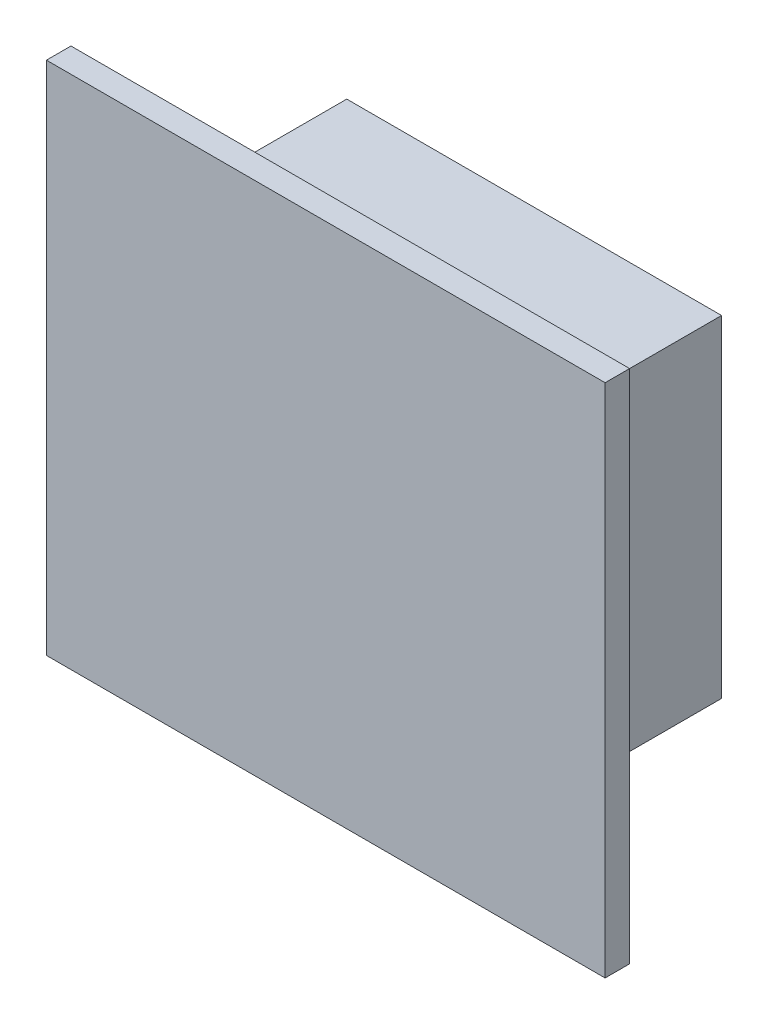
ISO-10303-21;
HEADER;
FILE_DESCRIPTION(('STEP AP214'),'2;1');
FILE_NAME('part.step','',(''),(''),'','','');
FILE_SCHEMA(('AUTOMOTIVE_DESIGN { 1 0 10303 214 1 1 1 1 }'));
ENDSEC;
DATA;
#1=APPLICATION_CONTEXT('core data for automotive mechanical design processes');
#2=APPLICATION_PROTOCOL_DEFINITION('international standard','automotive_design',2000,#1);
#3=PRODUCT_CONTEXT('',#1,'mechanical');
#4=PRODUCT('Part','Part','',(#3));
#5=PRODUCT_RELATED_PRODUCT_CATEGORY('part','',(#4));
#6=PRODUCT_DEFINITION_FORMATION('','',#4);
#7=PRODUCT_DEFINITION_CONTEXT('part definition',#1,'design');
#8=PRODUCT_DEFINITION('design','',#6,#7);
#9=PRODUCT_DEFINITION_SHAPE('','',#8);
#10=(LENGTH_UNIT() NAMED_UNIT(*) SI_UNIT(.MILLI.,.METRE.));
#11=(NAMED_UNIT(*) PLANE_ANGLE_UNIT() SI_UNIT($,.RADIAN.));
#12=(NAMED_UNIT(*) SI_UNIT($,.STERADIAN.) SOLID_ANGLE_UNIT());
#13=UNCERTAINTY_MEASURE_WITH_UNIT(LENGTH_MEASURE(1.E-05),#10,'distance_accuracy_value','');
#14=(GEOMETRIC_REPRESENTATION_CONTEXT(3) GLOBAL_UNCERTAINTY_ASSIGNED_CONTEXT((#13)) GLOBAL_UNIT_ASSIGNED_CONTEXT((#10,
#11,#12)) REPRESENTATION_CONTEXT('',''));
#15=CARTESIAN_POINT('',(0.,0.,0.));
#16=DIRECTION('',(0.,0.,1.));
#17=DIRECTION('',(1.,0.,0.));
#18=AXIS2_PLACEMENT_3D('',#15,#16,#17);
#19=CARTESIAN_POINT('',(0.,0.,0.));
#20=DIRECTION('',(0.,0.,-1.));
#21=DIRECTION('',(-1.,0.,0.));
#22=AXIS2_PLACEMENT_3D('',#19,#20,#21);
#23=PLANE('',#22);
#24=DIRECTION('',(0.,1.,0.));
#25=VECTOR('',#24,1.);
#26=CARTESIAN_POINT('',(40.4241041992261,-41.4117147130097,0.));
#27=LINE('',#26,#25);
#28=CARTESIAN_POINT('',(40.4241041992261,-46.8232067011669,0.));
#29=VERTEX_POINT('',#28);
#30=CARTESIAN_POINT('',(40.4241041992261,-41.4117147130097,0.));
#31=VERTEX_POINT('',#30);
#32=EDGE_CURVE('E54',#29,#31,#27,.T.);
#33=ORIENTED_EDGE('',*,*,#32,.F.);
#34=DIRECTION('',(-1.,0.,0.));
#35=VECTOR('',#34,1.);
#36=CARTESIAN_POINT('',(40.4241041992261,-46.8232067011669,0.));
#37=LINE('',#36,#35);
#38=CARTESIAN_POINT('',(46.5392965275469,-46.8232067011669,0.));
#39=VERTEX_POINT('',#38);
#40=EDGE_CURVE('E58',#39,#29,#37,.T.);
#41=ORIENTED_EDGE('',*,*,#40,.F.);
#42=DIRECTION('',(0.,-1.,0.));
#43=VECTOR('',#42,1.);
#44=CARTESIAN_POINT('',(46.5392965275469,-41.4117147130097,0.));
#45=LINE('',#44,#43);
#46=CARTESIAN_POINT('',(46.5392965275469,-41.4117147130097,0.));
#47=VERTEX_POINT('',#46);
#48=EDGE_CURVE('E286',#47,#39,#45,.T.);
#49=ORIENTED_EDGE('',*,*,#48,.F.);
#50=DIRECTION('',(1.,0.,0.));
#51=VECTOR('',#50,1.);
#52=CARTESIAN_POINT('',(40.4241041992261,-41.4117147130097,0.));
#53=LINE('',#52,#51);
#54=EDGE_CURVE('E292',#31,#47,#53,.T.);
#55=ORIENTED_EDGE('',*,*,#54,.F.);
#56=EDGE_LOOP('',(#33,#41,#49,#55));
#57=FACE_BOUND('',#56,.T.);
#58=DIRECTION('',(0.,1.,0.));
#59=VECTOR('',#58,1.);
#60=CARTESIAN_POINT('',(48.0392965275469,-39.9117147130097,0.));
#61=LINE('',#60,#59);
#62=CARTESIAN_POINT('',(48.0392965275469,-48.3232067011669,0.));
#63=VERTEX_POINT('',#62);
#64=CARTESIAN_POINT('',(48.0392965275469,-39.9117147130097,0.));
#65=VERTEX_POINT('',#64);
#66=EDGE_CURVE('E124',#63,#65,#61,.T.);
#67=ORIENTED_EDGE('',*,*,#66,.F.);
#68=DIRECTION('',(1.,0.,0.));
#69=VECTOR('',#68,1.);
#70=CARTESIAN_POINT('',(48.0392965275469,-48.3232067011669,0.));
#71=LINE('',#70,#69);
#72=CARTESIAN_POINT('',(38.9241041992261,-48.3232067011669,0.));
#73=VERTEX_POINT('',#72);
#74=EDGE_CURVE('E143',#73,#63,#71,.T.);
#75=ORIENTED_EDGE('',*,*,#74,.F.);
#76=DIRECTION('',(0.,-1.,0.));
#77=VECTOR('',#76,1.);
#78=CARTESIAN_POINT('',(38.9241041992261,-39.9117147130097,0.));
#79=LINE('',#78,#77);
#80=CARTESIAN_POINT('',(38.9241041992261,-39.9117147130097,0.));
#81=VERTEX_POINT('',#80);
#82=EDGE_CURVE('E140',#81,#73,#79,.T.);
#83=ORIENTED_EDGE('',*,*,#82,.F.);
#84=DIRECTION('',(-1.,0.,0.));
#85=VECTOR('',#84,1.);
#86=CARTESIAN_POINT('',(48.0392965275469,-39.9117147130097,0.));
#87=LINE('',#86,#85);
#88=EDGE_CURVE('E127',#65,#81,#87,.T.);
#89=ORIENTED_EDGE('',*,*,#88,.F.);
#90=EDGE_LOOP('',(#67,#75,#83,#89));
#91=FACE_BOUND('',#90,.T.);
#92=ADVANCED_FACE('F37',(#57,#91),#23,.T.);
#93=CARTESIAN_POINT('',(48.0392965275469,-48.3232067011669,12.8032225106668));
#94=DIRECTION('',(0.,1.,0.));
#95=DIRECTION('',(0.,0.,1.));
#96=AXIS2_PLACEMENT_3D('',#93,#94,#95);
#97=PLANE('',#96);
#98=DIRECTION('',(0.,0.,-1.));
#99=VECTOR('',#98,1.);
#100=CARTESIAN_POINT('',(48.0392965275469,-48.3232067011669,12.8032225106668));
#101=LINE('',#100,#99);
#102=CARTESIAN_POINT('',(48.0392965275469,-48.3232067011669,0.400000000000005));
#103=VERTEX_POINT('',#102);
#104=EDGE_CURVE('E146',#103,#63,#101,.T.);
#105=ORIENTED_EDGE('',*,*,#104,.F.);
#106=DIRECTION('',(-1.,0.,0.));
#107=VECTOR('',#106,1.);
#108=CARTESIAN_POINT('',(48.0392965275469,-48.3232067011669,0.400000000000005));
#109=LINE('',#108,#107);
#110=CARTESIAN_POINT('',(38.9241041992261,-48.3232067011669,0.400000000000008));
#111=VERTEX_POINT('',#110);
#112=EDGE_CURVE('E41',#103,#111,#109,.T.);
#113=ORIENTED_EDGE('',*,*,#112,.T.);
#114=DIRECTION('',(0.,0.,-1.));
#115=VECTOR('',#114,1.);
#116=CARTESIAN_POINT('',(38.9241041992261,-48.3232067011669,12.8032225106668));
#117=LINE('',#116,#115);
#118=EDGE_CURVE('E148',#111,#73,#117,.T.);
#119=ORIENTED_EDGE('',*,*,#118,.T.);
#120=ORIENTED_EDGE('',*,*,#74,.T.);
#121=EDGE_LOOP('',(#105,#113,#119,#120));
#122=FACE_BOUND('',#121,.T.);
#123=ADVANCED_FACE('F158',(#122),#97,.F.);
#124=CARTESIAN_POINT('',(38.9241041992261,-39.9117147130097,12.8032225106668));
#125=DIRECTION('',(1.,0.,0.));
#126=DIRECTION('',(0.,0.,-1.));
#127=AXIS2_PLACEMENT_3D('',#124,#125,#126);
#128=PLANE('',#127);
#129=ORIENTED_EDGE('',*,*,#118,.F.);
#130=DIRECTION('',(0.,1.,0.));
#131=VECTOR('',#130,1.);
#132=CARTESIAN_POINT('',(38.9241041992261,-39.9117147130097,0.400000000000005));
#133=LINE('',#132,#131);
#134=CARTESIAN_POINT('',(38.9241041992261,-39.9117147130097,0.400000000000005));
#135=VERTEX_POINT('',#134);
#136=EDGE_CURVE('E133',#111,#135,#133,.T.);
#137=ORIENTED_EDGE('',*,*,#136,.T.);
#138=DIRECTION('',(0.,0.,-1.));
#139=VECTOR('',#138,1.);
#140=CARTESIAN_POINT('',(38.9241041992261,-39.9117147130097,12.8032225106668));
#141=LINE('',#140,#139);
#142=EDGE_CURVE('E150',#135,#81,#141,.T.);
#143=ORIENTED_EDGE('',*,*,#142,.T.);
#144=ORIENTED_EDGE('',*,*,#82,.T.);
#145=EDGE_LOOP('',(#129,#137,#143,#144));
#146=FACE_BOUND('',#145,.T.);
#147=ADVANCED_FACE('F168',(#146),#128,.F.);
#148=CARTESIAN_POINT('',(48.0392965275469,-39.9117147130097,12.8032225106668));
#149=DIRECTION('',(0.,-1.,0.));
#150=DIRECTION('',(0.,0.,-1.));
#151=AXIS2_PLACEMENT_3D('',#148,#149,#150);
#152=PLANE('',#151);
#153=ORIENTED_EDGE('',*,*,#142,.F.);
#154=DIRECTION('',(1.,0.,0.));
#155=VECTOR('',#154,1.);
#156=CARTESIAN_POINT('',(48.0392965275469,-39.9117147130097,0.400000000000005));
#157=LINE('',#156,#155);
#158=CARTESIAN_POINT('',(48.0392965275469,-39.9117147130097,0.400000000000005));
#159=VERTEX_POINT('',#158);
#160=EDGE_CURVE('E46',#135,#159,#157,.T.);
#161=ORIENTED_EDGE('',*,*,#160,.T.);
#162=DIRECTION('',(0.,0.,-1.));
#163=VECTOR('',#162,1.);
#164=CARTESIAN_POINT('',(48.0392965275469,-39.9117147130097,12.8032225106668));
#165=LINE('',#164,#163);
#166=EDGE_CURVE('E151',#159,#65,#165,.T.);
#167=ORIENTED_EDGE('',*,*,#166,.T.);
#168=ORIENTED_EDGE('',*,*,#88,.T.);
#169=EDGE_LOOP('',(#153,#161,#167,#168));
#170=FACE_BOUND('',#169,.T.);
#171=ADVANCED_FACE('F165',(#170),#152,.F.);
#172=CARTESIAN_POINT('',(48.0392965275469,-39.9117147130097,12.8032225106668));
#173=DIRECTION('',(-1.,0.,0.));
#174=DIRECTION('',(0.,0.,1.));
#175=AXIS2_PLACEMENT_3D('',#172,#173,#174);
#176=PLANE('',#175);
#177=ORIENTED_EDGE('',*,*,#166,.F.);
#178=DIRECTION('',(0.,-1.,0.));
#179=VECTOR('',#178,1.);
#180=CARTESIAN_POINT('',(48.0392965275469,-39.9117147130097,0.400000000000005));
#181=LINE('',#180,#179);
#182=EDGE_CURVE('E11',#159,#103,#181,.T.);
#183=ORIENTED_EDGE('',*,*,#182,.T.);
#184=ORIENTED_EDGE('',*,*,#104,.T.);
#185=ORIENTED_EDGE('',*,*,#66,.T.);
#186=EDGE_LOOP('',(#177,#183,#184,#185));
#187=FACE_BOUND('',#186,.T.);
#188=ADVANCED_FACE('F39',(#187),#176,.F.);
#189=CARTESIAN_POINT('',(43.55001326485,-44.39700844725,0.400000000000004));
#190=DIRECTION('',(0.,0.,-1.));
#191=DIRECTION('',(-1.,0.,0.));
#192=AXIS2_PLACEMENT_3D('',#189,#190,#191);
#193=PLANE('',#192);
#194=ORIENTED_EDGE('',*,*,#160,.F.);
#195=ORIENTED_EDGE('',*,*,#136,.F.);
#196=ORIENTED_EDGE('',*,*,#112,.F.);
#197=ORIENTED_EDGE('',*,*,#182,.F.);
#198=EDGE_LOOP('',(#194,#195,#196,#197));
#199=FACE_BOUND('',#198,.T.);
#200=ADVANCED_FACE('F161',(#199),#193,.F.);
#201=CARTESIAN_POINT('',(40.4241041992261,-41.4117147130097,-3.));
#202=DIRECTION('',(1.,0.,0.));
#203=DIRECTION('',(0.,0.,-1.));
#204=AXIS2_PLACEMENT_3D('',#201,#202,#203);
#205=PLANE('',#204);
#206=ORIENTED_EDGE('',*,*,#32,.T.);
#207=DIRECTION('',(0.,0.,1.));
#208=VECTOR('',#207,1.);
#209=CARTESIAN_POINT('',(40.4241041992261,-41.4117147130097,-3.));
#210=LINE('',#209,#208);
#211=CARTESIAN_POINT('',(40.4241041992261,-41.4117147130097,-3.));
#212=VERTEX_POINT('',#211);
#213=EDGE_CURVE('E107',#212,#31,#210,.T.);
#214=ORIENTED_EDGE('',*,*,#213,.F.);
#215=DIRECTION('',(0.,1.,0.));
#216=VECTOR('',#215,1.);
#217=CARTESIAN_POINT('',(40.4241041992261,-41.4117147130097,-3.));
#218=LINE('',#217,#216);
#219=CARTESIAN_POINT('',(40.4241041992261,-46.8232067011669,-3.));
#220=VERTEX_POINT('',#219);
#221=EDGE_CURVE('E113',#220,#212,#218,.T.);
#222=ORIENTED_EDGE('',*,*,#221,.F.);
#223=DIRECTION('',(0.,0.,1.));
#224=VECTOR('',#223,1.);
#225=CARTESIAN_POINT('',(40.4241041992261,-46.8232067011669,-3.));
#226=LINE('',#225,#224);
#227=EDGE_CURVE('E284',#220,#29,#226,.T.);
#228=ORIENTED_EDGE('',*,*,#227,.T.);
#229=EDGE_LOOP('',(#206,#214,#222,#228));
#230=FACE_BOUND('',#229,.T.);
#231=ADVANCED_FACE('F123',(#230),#205,.F.);
#232=CARTESIAN_POINT('',(40.4241041992261,-41.4117147130097,-3.));
#233=DIRECTION('',(0.,-1.,0.));
#234=DIRECTION('',(0.,0.,-1.));
#235=AXIS2_PLACEMENT_3D('',#232,#233,#234);
#236=PLANE('',#235);
#237=ORIENTED_EDGE('',*,*,#54,.T.);
#238=DIRECTION('',(0.,0.,1.));
#239=VECTOR('',#238,1.);
#240=CARTESIAN_POINT('',(46.5392965275469,-41.4117147130097,-3.));
#241=LINE('',#240,#239);
#242=CARTESIAN_POINT('',(46.5392965275469,-41.4117147130097,-3.));
#243=VERTEX_POINT('',#242);
#244=EDGE_CURVE('E109',#243,#47,#241,.T.);
#245=ORIENTED_EDGE('',*,*,#244,.F.);
#246=DIRECTION('',(1.,0.,0.));
#247=VECTOR('',#246,1.);
#248=CARTESIAN_POINT('',(40.4241041992261,-41.4117147130097,-3.));
#249=LINE('',#248,#247);
#250=EDGE_CURVE('E102',#212,#243,#249,.T.);
#251=ORIENTED_EDGE('',*,*,#250,.F.);
#252=ORIENTED_EDGE('',*,*,#213,.T.);
#253=EDGE_LOOP('',(#237,#245,#251,#252));
#254=FACE_BOUND('',#253,.T.);
#255=ADVANCED_FACE('F105',(#254),#236,.F.);
#256=CARTESIAN_POINT('',(46.5392965275469,-41.4117147130097,-3.));
#257=DIRECTION('',(-1.,0.,0.));
#258=DIRECTION('',(0.,0.,1.));
#259=AXIS2_PLACEMENT_3D('',#256,#257,#258);
#260=PLANE('',#259);
#261=ORIENTED_EDGE('',*,*,#48,.T.);
#262=DIRECTION('',(0.,0.,1.));
#263=VECTOR('',#262,1.);
#264=CARTESIAN_POINT('',(46.5392965275469,-46.8232067011669,-3.));
#265=LINE('',#264,#263);
#266=CARTESIAN_POINT('',(46.5392965275469,-46.8232067011669,-3.));
#267=VERTEX_POINT('',#266);
#268=EDGE_CURVE('E129',#267,#39,#265,.T.);
#269=ORIENTED_EDGE('',*,*,#268,.F.);
#270=DIRECTION('',(0.,-1.,0.));
#271=VECTOR('',#270,1.);
#272=CARTESIAN_POINT('',(46.5392965275469,-41.4117147130097,-3.));
#273=LINE('',#272,#271);
#274=EDGE_CURVE('E112',#243,#267,#273,.T.);
#275=ORIENTED_EDGE('',*,*,#274,.F.);
#276=ORIENTED_EDGE('',*,*,#244,.T.);
#277=EDGE_LOOP('',(#261,#269,#275,#276));
#278=FACE_BOUND('',#277,.T.);
#279=ADVANCED_FACE('F194',(#278),#260,.F.);
#280=CARTESIAN_POINT('',(40.4241041992261,-46.8232067011669,-3.));
#281=DIRECTION('',(0.,1.,0.));
#282=DIRECTION('',(0.,0.,1.));
#283=AXIS2_PLACEMENT_3D('',#280,#281,#282);
#284=PLANE('',#283);
#285=ORIENTED_EDGE('',*,*,#40,.T.);
#286=ORIENTED_EDGE('',*,*,#227,.F.);
#287=DIRECTION('',(-1.,0.,0.));
#288=VECTOR('',#287,1.);
#289=CARTESIAN_POINT('',(40.4241041992261,-46.8232067011669,-3.));
#290=LINE('',#289,#288);
#291=EDGE_CURVE('E118',#267,#220,#290,.T.);
#292=ORIENTED_EDGE('',*,*,#291,.F.);
#293=ORIENTED_EDGE('',*,*,#268,.T.);
#294=EDGE_LOOP('',(#285,#286,#292,#293));
#295=FACE_BOUND('',#294,.T.);
#296=ADVANCED_FACE('F199',(#295),#284,.F.);
#297=CARTESIAN_POINT('',(0.,0.,-3.));
#298=DIRECTION('',(0.,0.,1.));
#299=DIRECTION('',(1.,0.,0.));
#300=AXIS2_PLACEMENT_3D('',#297,#298,#299);
#301=PLANE('',#300);
#302=ORIENTED_EDGE('',*,*,#221,.T.);
#303=ORIENTED_EDGE('',*,*,#250,.T.);
#304=ORIENTED_EDGE('',*,*,#274,.T.);
#305=ORIENTED_EDGE('',*,*,#291,.T.);
#306=EDGE_LOOP('',(#302,#303,#304,#305));
#307=FACE_BOUND('',#306,.T.);
#308=ADVANCED_FACE('F116',(#307),#301,.F.);
#309=CLOSED_SHELL('',(#92,#123,#147,#171,#188,#200,#231,#255,#279,#296,#308));
#310=MANIFOLD_SOLID_BREP('B2',#309);
#311=ADVANCED_BREP_SHAPE_REPRESENTATION('',(#18,#310),#14);
#312=SHAPE_DEFINITION_REPRESENTATION(#9,#311);
ENDSEC;
END-ISO-10303-21;
